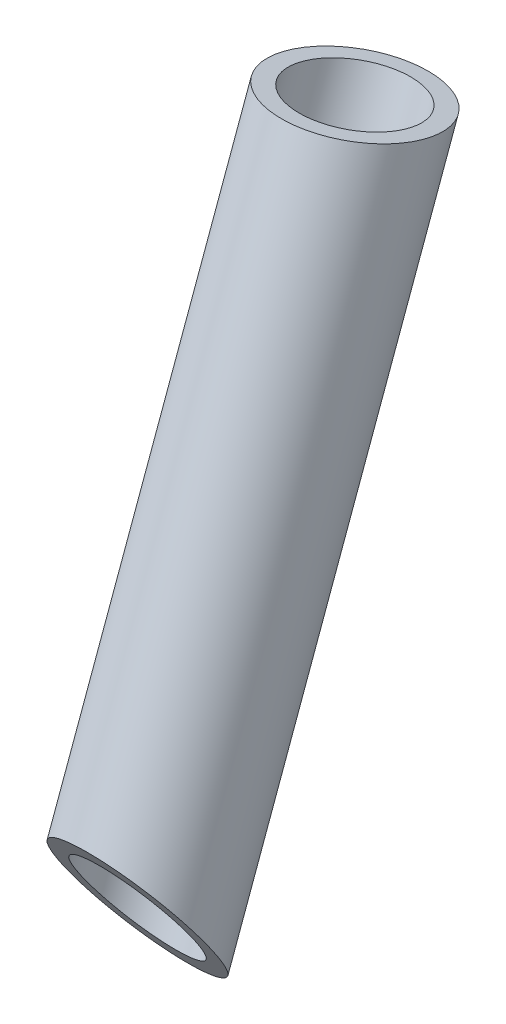
ISO-10303-21;
HEADER;
FILE_DESCRIPTION(('STEP AP214'),'2;1');
FILE_NAME('part.step','',(''),(''),'','','');
FILE_SCHEMA(('AUTOMOTIVE_DESIGN { 1 0 10303 214 1 1 1 1 }'));
ENDSEC;
DATA;
#1=APPLICATION_CONTEXT('core data for automotive mechanical design processes');
#2=APPLICATION_PROTOCOL_DEFINITION('international standard','automotive_design',2000,#1);
#3=PRODUCT_CONTEXT('',#1,'mechanical');
#4=PRODUCT('Part','Part','',(#3));
#5=PRODUCT_RELATED_PRODUCT_CATEGORY('part','',(#4));
#6=PRODUCT_DEFINITION_FORMATION('','',#4);
#7=PRODUCT_DEFINITION_CONTEXT('part definition',#1,'design');
#8=PRODUCT_DEFINITION('design','',#6,#7);
#9=PRODUCT_DEFINITION_SHAPE('','',#8);
#10=(LENGTH_UNIT() NAMED_UNIT(*) SI_UNIT(.MILLI.,.METRE.));
#11=(NAMED_UNIT(*) PLANE_ANGLE_UNIT() SI_UNIT($,.RADIAN.));
#12=(NAMED_UNIT(*) SI_UNIT($,.STERADIAN.) SOLID_ANGLE_UNIT());
#13=UNCERTAINTY_MEASURE_WITH_UNIT(LENGTH_MEASURE(1.E-05),#10,'distance_accuracy_value','');
#14=(GEOMETRIC_REPRESENTATION_CONTEXT(3) GLOBAL_UNCERTAINTY_ASSIGNED_CONTEXT((#13)) GLOBAL_UNIT_ASSIGNED_CONTEXT((#10,
#11,#12)) REPRESENTATION_CONTEXT('',''));
#15=CARTESIAN_POINT('',(0.,0.,0.));
#16=DIRECTION('',(0.,0.,1.));
#17=DIRECTION('',(1.,0.,0.));
#18=AXIS2_PLACEMENT_3D('',#15,#16,#17);
#19=CARTESIAN_POINT('',(899.196916053029,101.086343763392,-238.011921297441));
#20=DIRECTION('',(0.00743596247195737,-0.935984664475876,0.351962234235575));
#21=DIRECTION('',(0.,-0.35197196525769,-0.936010542500799));
#22=AXIS2_PLACEMENT_3D('',#19,#20,#21);
#23=CYLINDRICAL_SURFACE('',#22,9.65000000000004);
#24=CARTESIAN_POINT('',(899.196916053029,101.086343763392,-238.011921297441));
#25=DIRECTION('',(0.00143638782424152,-0.977156337317368,0.212516891635755));
#26=DIRECTION('',(0.0414428460712229,0.212392700268518,0.976305193769943));
#27=AXIS2_PLACEMENT_3D('',#24,#25,#26);
#28=ELLIPSE('',#27,9.75326811540505,9.65000000000004);
#29=CARTESIAN_POINT('',(899.601119242227,103.157866714865,-228.48975498014));
#30=VERTEX_POINT('',#29);
#31=EDGE_CURVE('E47',#30,#30,#28,.T.);
#32=ORIENTED_EDGE('',*,*,#31,.F.);
#33=EDGE_LOOP('',(#32));
#34=FACE_BOUND('',#33,.T.);
#35=CARTESIAN_POINT('',(900.,0.,-200.));
#36=DIRECTION('',(0.0045220973909886,-0.569208602813942,0.822180708310397));
#37=DIRECTION('',(0.00653163689339619,-0.822154763312406,-0.569226565509916));
#38=AXIS2_PLACEMENT_3D('',#35,#36,#37);
#39=ELLIPSE('',#38,11.7370790903511,9.65000000000004);
#40=CARTESIAN_POINT('',(900.076662338807,-9.64969548150654,-206.681057219719));
#41=VERTEX_POINT('',#40);
#42=EDGE_CURVE('E42',#41,#41,#39,.T.);
#43=ORIENTED_EDGE('',*,*,#42,.T.);
#44=EDGE_LOOP('',(#43));
#45=FACE_BOUND('',#44,.T.);
#46=ADVANCED_FACE('F38',(#34,#45),#23,.F.);
#47=CARTESIAN_POINT('',(899.196916053029,101.086343763392,-238.011921297441));
#48=DIRECTION('',(0.00743596247195737,-0.935984664475876,0.351962234235575));
#49=DIRECTION('',(0.,-0.35197196525769,-0.936010542500799));
#50=AXIS2_PLACEMENT_3D('',#47,#48,#49);
#51=CYLINDRICAL_SURFACE('',#50,12.7);
#52=CARTESIAN_POINT('',(899.196916053029,101.086343763392,-238.011921297441));
#53=DIRECTION('',(0.00143638782424152,-0.977156337317368,0.212516891635755));
#54=DIRECTION('',(0.0414428460712229,0.212392700268518,0.976305193769943));
#55=AXIS2_PLACEMENT_3D('',#52,#53,#54);
#56=ELLIPSE('',#55,12.8359072606885,12.7);
#57=CARTESIAN_POINT('',(899.728872581818,103.812596766886,-225.480158372082));
#58=VERTEX_POINT('',#57);
#59=EDGE_CURVE('E53',#58,#58,#56,.T.);
#60=ORIENTED_EDGE('',*,*,#59,.T.);
#61=EDGE_LOOP('',(#60));
#62=FACE_BOUND('',#61,.T.);
#63=CARTESIAN_POINT('',(900.,0.,-200.));
#64=DIRECTION('',(0.0045220973909886,-0.569208602813942,0.822180708310397));
#65=DIRECTION('',(0.00653163689339619,-0.822154763312406,-0.569226565509916));
#66=AXIS2_PLACEMENT_3D('',#63,#64,#65);
#67=ELLIPSE('',#66,15.4467258494776,12.7);
#68=CARTESIAN_POINT('',(900.100892404441,-12.6995992347288,-208.792686703671));
#69=VERTEX_POINT('',#68);
#70=EDGE_CURVE('E10',#69,#69,#67,.T.);
#71=ORIENTED_EDGE('',*,*,#70,.F.);
#72=EDGE_LOOP('',(#71));
#73=FACE_BOUND('',#72,.T.);
#74=ADVANCED_FACE('F73',(#62,#73),#51,.T.);
#75=CARTESIAN_POINT('',(899.196916053029,101.086343763392,-238.011921297441));
#76=DIRECTION('',(0.00143638782424152,-0.977156337317368,0.212516891635755));
#77=DIRECTION('',(0.,-0.21251711086958,-0.977157345358283));
#78=AXIS2_PLACEMENT_3D('',#75,#76,#77);
#79=PLANE('',#78);
#80=ORIENTED_EDGE('',*,*,#31,.T.);
#81=EDGE_LOOP('',(#80));
#82=FACE_BOUND('',#81,.T.);
#83=ORIENTED_EDGE('',*,*,#59,.F.);
#84=EDGE_LOOP('',(#83));
#85=FACE_BOUND('',#84,.T.);
#86=ADVANCED_FACE('F68',(#82,#85),#79,.F.);
#87=CARTESIAN_POINT('',(900.,0.,-200.));
#88=DIRECTION('',(0.0045220973909886,-0.569208602813942,0.822180708310397));
#89=DIRECTION('',(0.,-0.822189114975954,-0.569214422880393));
#90=AXIS2_PLACEMENT_3D('',#87,#88,#89);
#91=PLANE('',#90);
#92=ORIENTED_EDGE('',*,*,#42,.F.);
#93=EDGE_LOOP('',(#92));
#94=FACE_BOUND('',#93,.T.);
#95=ORIENTED_EDGE('',*,*,#70,.T.);
#96=EDGE_LOOP('',(#95));
#97=FACE_BOUND('',#96,.T.);
#98=ADVANCED_FACE('F40',(#94,#97),#91,.T.);
#99=CLOSED_SHELL('',(#46,#74,#86,#98));
#100=MANIFOLD_SOLID_BREP('B2',#99);
#101=ADVANCED_BREP_SHAPE_REPRESENTATION('',(#18,#100),#14);
#102=SHAPE_DEFINITION_REPRESENTATION(#9,#101);
ENDSEC;
END-ISO-10303-21;
